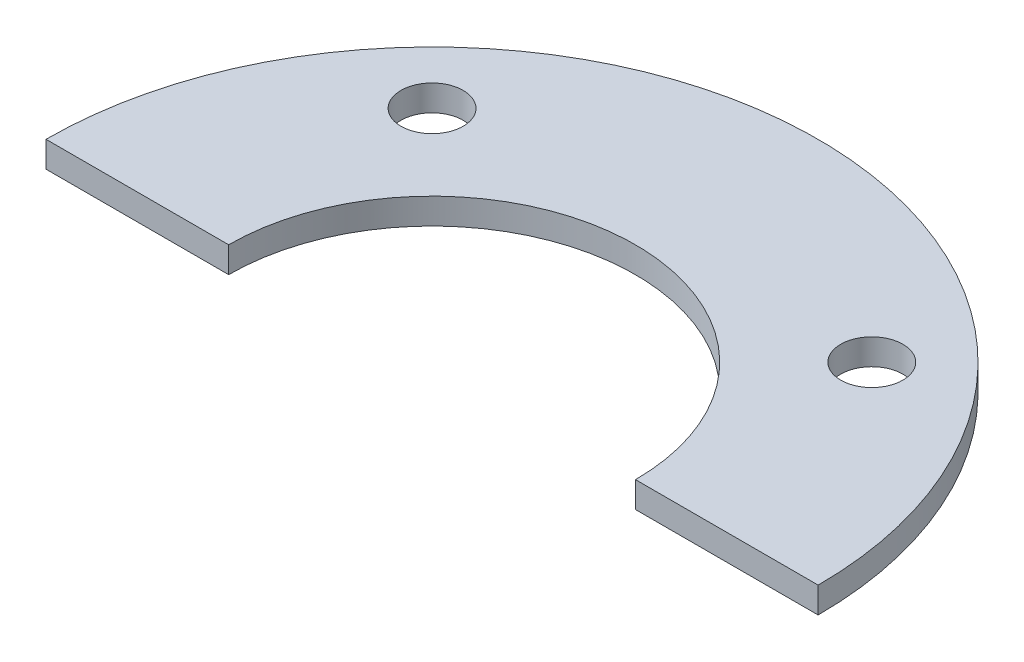
ISO-10303-21;
HEADER;
FILE_DESCRIPTION(('STEP AP214'),'2;1');
FILE_NAME('part.step','',(''),(''),'','','');
FILE_SCHEMA(('AUTOMOTIVE_DESIGN { 1 0 10303 214 1 1 1 1 }'));
ENDSEC;
DATA;
#1=APPLICATION_CONTEXT('core data for automotive mechanical design processes');
#2=APPLICATION_PROTOCOL_DEFINITION('international standard','automotive_design',2000,#1);
#3=PRODUCT_CONTEXT('',#1,'mechanical');
#4=PRODUCT('Part','Part','',(#3));
#5=PRODUCT_RELATED_PRODUCT_CATEGORY('part','',(#4));
#6=PRODUCT_DEFINITION_FORMATION('','',#4);
#7=PRODUCT_DEFINITION_CONTEXT('part definition',#1,'design');
#8=PRODUCT_DEFINITION('design','',#6,#7);
#9=PRODUCT_DEFINITION_SHAPE('','',#8);
#10=(LENGTH_UNIT() NAMED_UNIT(*) SI_UNIT(.MILLI.,.METRE.));
#11=(NAMED_UNIT(*) PLANE_ANGLE_UNIT() SI_UNIT($,.RADIAN.));
#12=(NAMED_UNIT(*) SI_UNIT($,.STERADIAN.) SOLID_ANGLE_UNIT());
#13=UNCERTAINTY_MEASURE_WITH_UNIT(LENGTH_MEASURE(1.E-05),#10,'distance_accuracy_value','');
#14=(GEOMETRIC_REPRESENTATION_CONTEXT(3) GLOBAL_UNCERTAINTY_ASSIGNED_CONTEXT((#13)) GLOBAL_UNIT_ASSIGNED_CONTEXT((#10,
#11,#12)) REPRESENTATION_CONTEXT('',''));
#15=CARTESIAN_POINT('',(0.,0.,0.));
#16=DIRECTION('',(0.,0.,1.));
#17=DIRECTION('',(1.,0.,0.));
#18=AXIS2_PLACEMENT_3D('',#15,#16,#17);
#19=CARTESIAN_POINT('',(0.,1.27,0.));
#20=DIRECTION('',(0.,-1.,0.));
#21=DIRECTION('',(0.,0.,-1.));
#22=AXIS2_PLACEMENT_3D('',#19,#20,#21);
#23=CYLINDRICAL_SURFACE('',#22,9.9695);
#24=CARTESIAN_POINT('',(0.,0.,0.));
#25=DIRECTION('',(0.,-1.,0.));
#26=DIRECTION('',(0.,0.,-1.));
#27=AXIS2_PLACEMENT_3D('',#24,#25,#26);
#28=CIRCLE('',#27,9.9695);
#29=CARTESIAN_POINT('',(-9.9695,0.,0.));
#30=VERTEX_POINT('',#29);
#31=CARTESIAN_POINT('',(9.9695,0.,0.));
#32=VERTEX_POINT('',#31);
#33=EDGE_CURVE('E117',#30,#32,#28,.T.);
#34=ORIENTED_EDGE('',*,*,#33,.T.);
#35=DIRECTION('',(0.,-1.,0.));
#36=VECTOR('',#35,1.);
#37=CARTESIAN_POINT('',(9.9695,1.27,0.));
#38=LINE('',#37,#36);
#39=CARTESIAN_POINT('',(9.9695,1.27,0.));
#40=VERTEX_POINT('',#39);
#41=EDGE_CURVE('E11',#40,#32,#38,.T.);
#42=ORIENTED_EDGE('',*,*,#41,.F.);
#43=CARTESIAN_POINT('',(0.,1.27,0.));
#44=DIRECTION('',(0.,-1.,0.));
#45=DIRECTION('',(0.,0.,-1.));
#46=AXIS2_PLACEMENT_3D('',#43,#44,#45);
#47=CIRCLE('',#46,9.9695);
#48=CARTESIAN_POINT('',(-9.9695,1.27,0.));
#49=VERTEX_POINT('',#48);
#50=EDGE_CURVE('E99',#49,#40,#47,.T.);
#51=ORIENTED_EDGE('',*,*,#50,.F.);
#52=DIRECTION('',(0.,-1.,0.));
#53=VECTOR('',#52,1.);
#54=CARTESIAN_POINT('',(-9.9695,1.27,0.));
#55=LINE('',#54,#53);
#56=EDGE_CURVE('E113',#49,#30,#55,.T.);
#57=ORIENTED_EDGE('',*,*,#56,.T.);
#58=EDGE_LOOP('',(#34,#42,#51,#57));
#59=FACE_BOUND('',#58,.T.);
#60=ADVANCED_FACE('F39',(#59),#23,.F.);
#61=CARTESIAN_POINT('',(9.9695,1.27,0.));
#62=DIRECTION('',(0.,0.,-1.));
#63=DIRECTION('',(-1.,0.,0.));
#64=AXIS2_PLACEMENT_3D('',#61,#62,#63);
#65=PLANE('',#64);
#66=DIRECTION('',(1.,0.,0.));
#67=VECTOR('',#66,1.);
#68=CARTESIAN_POINT('',(9.9695,0.,0.));
#69=LINE('',#68,#67);
#70=CARTESIAN_POINT('',(18.923,0.,0.));
#71=VERTEX_POINT('',#70);
#72=EDGE_CURVE('E104',#32,#71,#69,.T.);
#73=ORIENTED_EDGE('',*,*,#72,.T.);
#74=DIRECTION('',(0.,-1.,0.));
#75=VECTOR('',#74,1.);
#76=CARTESIAN_POINT('',(18.923,1.27,0.));
#77=LINE('',#76,#75);
#78=CARTESIAN_POINT('',(18.923,1.27,0.));
#79=VERTEX_POINT('',#78);
#80=EDGE_CURVE('E48',#79,#71,#77,.T.);
#81=ORIENTED_EDGE('',*,*,#80,.F.);
#82=DIRECTION('',(1.,0.,0.));
#83=VECTOR('',#82,1.);
#84=CARTESIAN_POINT('',(9.9695,1.27,0.));
#85=LINE('',#84,#83);
#86=EDGE_CURVE('E94',#40,#79,#85,.T.);
#87=ORIENTED_EDGE('',*,*,#86,.F.);
#88=ORIENTED_EDGE('',*,*,#41,.T.);
#89=EDGE_LOOP('',(#73,#81,#87,#88));
#90=FACE_BOUND('',#89,.T.);
#91=ADVANCED_FACE('F103',(#90),#65,.F.);
#92=CARTESIAN_POINT('',(0.,1.27,0.));
#93=DIRECTION('',(0.,-1.,0.));
#94=DIRECTION('',(0.,0.,-1.));
#95=AXIS2_PLACEMENT_3D('',#92,#93,#94);
#96=CYLINDRICAL_SURFACE('',#95,18.923);
#97=CARTESIAN_POINT('',(0.,0.,0.));
#98=DIRECTION('',(0.,1.,0.));
#99=DIRECTION('',(0.,0.,-1.));
#100=AXIS2_PLACEMENT_3D('',#97,#98,#99);
#101=CIRCLE('',#100,18.923);
#102=CARTESIAN_POINT('',(-18.923,0.,0.));
#103=VERTEX_POINT('',#102);
#104=EDGE_CURVE('E79',#71,#103,#101,.T.);
#105=ORIENTED_EDGE('',*,*,#104,.T.);
#106=DIRECTION('',(0.,-1.,0.));
#107=VECTOR('',#106,1.);
#108=CARTESIAN_POINT('',(-18.923,1.27,0.));
#109=LINE('',#108,#107);
#110=CARTESIAN_POINT('',(-18.923,1.27,0.));
#111=VERTEX_POINT('',#110);
#112=EDGE_CURVE('E106',#111,#103,#109,.T.);
#113=ORIENTED_EDGE('',*,*,#112,.F.);
#114=CARTESIAN_POINT('',(0.,1.27,0.));
#115=DIRECTION('',(0.,1.,0.));
#116=DIRECTION('',(0.,0.,-1.));
#117=AXIS2_PLACEMENT_3D('',#114,#115,#116);
#118=CIRCLE('',#117,18.923);
#119=EDGE_CURVE('E97',#79,#111,#118,.T.);
#120=ORIENTED_EDGE('',*,*,#119,.F.);
#121=ORIENTED_EDGE('',*,*,#80,.T.);
#122=EDGE_LOOP('',(#105,#113,#120,#121));
#123=FACE_BOUND('',#122,.T.);
#124=ADVANCED_FACE('F107',(#123),#96,.T.);
#125=CARTESIAN_POINT('',(-9.9695,1.27,0.));
#126=DIRECTION('',(0.,0.,-1.));
#127=DIRECTION('',(-1.,0.,0.));
#128=AXIS2_PLACEMENT_3D('',#125,#126,#127);
#129=PLANE('',#128);
#130=DIRECTION('',(1.,0.,0.));
#131=VECTOR('',#130,1.);
#132=CARTESIAN_POINT('',(-9.9695,0.,0.));
#133=LINE('',#132,#131);
#134=EDGE_CURVE('E86',#103,#30,#133,.T.);
#135=ORIENTED_EDGE('',*,*,#134,.T.);
#136=ORIENTED_EDGE('',*,*,#56,.F.);
#137=DIRECTION('',(1.,0.,0.));
#138=VECTOR('',#137,1.);
#139=CARTESIAN_POINT('',(-9.9695,1.27,0.));
#140=LINE('',#139,#138);
#141=EDGE_CURVE('E59',#111,#49,#140,.T.);
#142=ORIENTED_EDGE('',*,*,#141,.F.);
#143=ORIENTED_EDGE('',*,*,#112,.T.);
#144=EDGE_LOOP('',(#135,#136,#142,#143));
#145=FACE_BOUND('',#144,.T.);
#146=ADVANCED_FACE('F131',(#145),#129,.F.);
#147=CARTESIAN_POINT('',(0.,1.27,0.));
#148=DIRECTION('',(0.,-1.,0.));
#149=DIRECTION('',(0.,0.,-1.));
#150=AXIS2_PLACEMENT_3D('',#147,#148,#149);
#151=PLANE('',#150);
#152=CARTESIAN_POINT('',(10.776307345283,1.27,-10.776307345283));
#153=DIRECTION('',(0.,1.,0.));
#154=DIRECTION('',(0.,0.,1.));
#155=AXIS2_PLACEMENT_3D('',#152,#153,#154);
#156=CIRCLE('',#155,1.524);
#157=CARTESIAN_POINT('',(10.776307345283,1.27,-9.25230734528297));
#158=VERTEX_POINT('',#157);
#159=EDGE_CURVE('E144',#158,#158,#156,.T.);
#160=ORIENTED_EDGE('',*,*,#159,.F.);
#161=EDGE_LOOP('',(#160));
#162=FACE_BOUND('',#161,.T.);
#163=CARTESIAN_POINT('',(-10.7763073452829,1.27,-10.776307345283));
#164=DIRECTION('',(0.,1.,0.));
#165=DIRECTION('',(0.,0.,1.));
#166=AXIS2_PLACEMENT_3D('',#163,#164,#165);
#167=CIRCLE('',#166,1.524);
#168=CARTESIAN_POINT('',(-10.7763073452829,1.27,-9.25230734528304));
#169=VERTEX_POINT('',#168);
#170=EDGE_CURVE('E137',#169,#169,#167,.T.);
#171=ORIENTED_EDGE('',*,*,#170,.F.);
#172=EDGE_LOOP('',(#171));
#173=FACE_BOUND('',#172,.T.);
#174=ORIENTED_EDGE('',*,*,#50,.T.);
#175=ORIENTED_EDGE('',*,*,#86,.T.);
#176=ORIENTED_EDGE('',*,*,#119,.T.);
#177=ORIENTED_EDGE('',*,*,#141,.T.);
#178=EDGE_LOOP('',(#174,#175,#176,#177));
#179=FACE_BOUND('',#178,.T.);
#180=ADVANCED_FACE('F95',(#162,#173,#179),#151,.F.);
#181=CARTESIAN_POINT('',(0.,0.,0.));
#182=DIRECTION('',(0.,-1.,0.));
#183=DIRECTION('',(0.,0.,-1.));
#184=AXIS2_PLACEMENT_3D('',#181,#182,#183);
#185=PLANE('',#184);
#186=CARTESIAN_POINT('',(10.776307345283,0.,-10.776307345283));
#187=DIRECTION('',(0.,1.,0.));
#188=DIRECTION('',(0.,0.,1.));
#189=AXIS2_PLACEMENT_3D('',#186,#187,#188);
#190=CIRCLE('',#189,1.524);
#191=CARTESIAN_POINT('',(10.776307345283,0.,-9.25230734528297));
#192=VERTEX_POINT('',#191);
#193=EDGE_CURVE('E141',#192,#192,#190,.T.);
#194=ORIENTED_EDGE('',*,*,#193,.T.);
#195=EDGE_LOOP('',(#194));
#196=FACE_BOUND('',#195,.T.);
#197=CARTESIAN_POINT('',(-10.7763073452829,0.,-10.776307345283));
#198=DIRECTION('',(0.,1.,0.));
#199=DIRECTION('',(0.,0.,1.));
#200=AXIS2_PLACEMENT_3D('',#197,#198,#199);
#201=CIRCLE('',#200,1.524);
#202=CARTESIAN_POINT('',(-10.7763073452829,0.,-9.25230734528304));
#203=VERTEX_POINT('',#202);
#204=EDGE_CURVE('E121',#203,#203,#201,.T.);
#205=ORIENTED_EDGE('',*,*,#204,.T.);
#206=EDGE_LOOP('',(#205));
#207=FACE_BOUND('',#206,.T.);
#208=ORIENTED_EDGE('',*,*,#33,.F.);
#209=ORIENTED_EDGE('',*,*,#134,.F.);
#210=ORIENTED_EDGE('',*,*,#104,.F.);
#211=ORIENTED_EDGE('',*,*,#72,.F.);
#212=EDGE_LOOP('',(#208,#209,#210,#211));
#213=FACE_BOUND('',#212,.T.);
#214=ADVANCED_FACE('F134',(#196,#207,#213),#185,.T.);
#215=CARTESIAN_POINT('',(-10.7763073452829,0.,-10.776307345283));
#216=DIRECTION('',(0.,1.,0.));
#217=DIRECTION('',(0.,0.,1.));
#218=AXIS2_PLACEMENT_3D('',#215,#216,#217);
#219=CYLINDRICAL_SURFACE('',#218,1.524);
#220=ORIENTED_EDGE('',*,*,#204,.F.);
#221=EDGE_LOOP('',(#220));
#222=FACE_BOUND('',#221,.T.);
#223=ORIENTED_EDGE('',*,*,#170,.T.);
#224=EDGE_LOOP('',(#223));
#225=FACE_BOUND('',#224,.T.);
#226=ADVANCED_FACE('F157',(#222,#225),#219,.F.);
#227=CARTESIAN_POINT('',(10.776307345283,0.,-10.776307345283));
#228=DIRECTION('',(0.,1.,0.));
#229=DIRECTION('',(0.,0.,1.));
#230=AXIS2_PLACEMENT_3D('',#227,#228,#229);
#231=CYLINDRICAL_SURFACE('',#230,1.524);
#232=ORIENTED_EDGE('',*,*,#193,.F.);
#233=EDGE_LOOP('',(#232));
#234=FACE_BOUND('',#233,.T.);
#235=ORIENTED_EDGE('',*,*,#159,.T.);
#236=EDGE_LOOP('',(#235));
#237=FACE_BOUND('',#236,.T.);
#238=ADVANCED_FACE('F154',(#234,#237),#231,.F.);
#239=CLOSED_SHELL('',(#60,#91,#124,#146,#180,#214,#226,#238));
#240=MANIFOLD_SOLID_BREP('B2',#239);
#241=ADVANCED_BREP_SHAPE_REPRESENTATION('',(#18,#240),#14);
#242=SHAPE_DEFINITION_REPRESENTATION(#9,#241);
ENDSEC;
END-ISO-10303-21;
